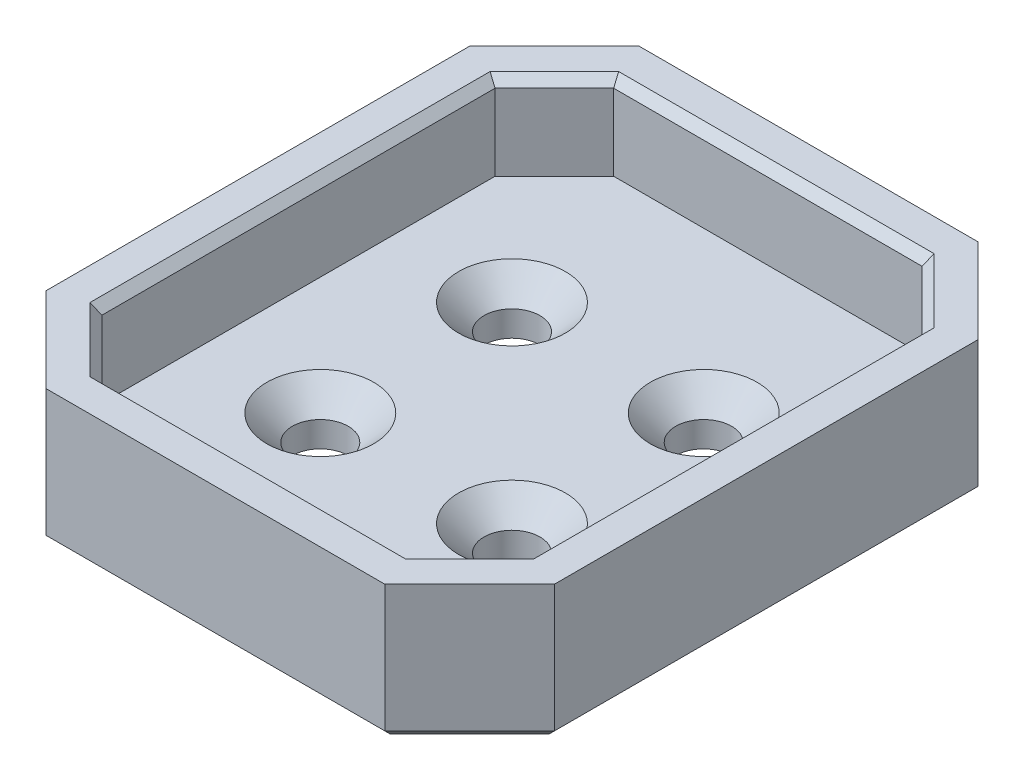
ISO-10303-21;
HEADER;
FILE_DESCRIPTION(('STEP AP214'),'2;1');
FILE_NAME('part.step','',(''),(''),'','','');
FILE_SCHEMA(('AUTOMOTIVE_DESIGN { 1 0 10303 214 1 1 1 1 }'));
ENDSEC;
DATA;
#1=APPLICATION_CONTEXT('core data for automotive mechanical design processes');
#2=APPLICATION_PROTOCOL_DEFINITION('international standard','automotive_design',2000,#1);
#3=PRODUCT_CONTEXT('',#1,'mechanical');
#4=PRODUCT('Part','Part','',(#3));
#5=PRODUCT_RELATED_PRODUCT_CATEGORY('part','',(#4));
#6=PRODUCT_DEFINITION_FORMATION('','',#4);
#7=PRODUCT_DEFINITION_CONTEXT('part definition',#1,'design');
#8=PRODUCT_DEFINITION('design','',#6,#7);
#9=PRODUCT_DEFINITION_SHAPE('','',#8);
#10=(LENGTH_UNIT() NAMED_UNIT(*) SI_UNIT(.MILLI.,.METRE.));
#11=(NAMED_UNIT(*) PLANE_ANGLE_UNIT() SI_UNIT($,.RADIAN.));
#12=(NAMED_UNIT(*) SI_UNIT($,.STERADIAN.) SOLID_ANGLE_UNIT());
#13=UNCERTAINTY_MEASURE_WITH_UNIT(LENGTH_MEASURE(1.E-05),#10,'distance_accuracy_value','');
#14=(GEOMETRIC_REPRESENTATION_CONTEXT(3) GLOBAL_UNCERTAINTY_ASSIGNED_CONTEXT((#13)) GLOBAL_UNIT_ASSIGNED_CONTEXT((#10,
#11,#12)) REPRESENTATION_CONTEXT('',''));
#15=CARTESIAN_POINT('',(0.,0.,0.));
#16=DIRECTION('',(0.,0.,1.));
#17=DIRECTION('',(1.,0.,0.));
#18=AXIS2_PLACEMENT_3D('',#15,#16,#17);
#19=CARTESIAN_POINT('',(0.,3.,0.));
#20=DIRECTION('',(0.,-1.,0.));
#21=DIRECTION('',(0.,0.,-1.));
#22=AXIS2_PLACEMENT_3D('',#19,#20,#21);
#23=PLANE('',#22);
#24=CARTESIAN_POINT('',(-5.65685424949235,3.,-5.65685424949241));
#25=DIRECTION('',(0.,1.,0.));
#26=DIRECTION('',(0.,0.,1.));
#27=AXIS2_PLACEMENT_3D('',#24,#25,#26);
#28=CIRCLE('',#27,3.15);
#29=CARTESIAN_POINT('',(-5.65685424949235,3.,-2.50685424949241));
#30=VERTEX_POINT('',#29);
#31=EDGE_CURVE('E350',#30,#30,#28,.T.);
#32=ORIENTED_EDGE('',*,*,#31,.F.);
#33=EDGE_LOOP('',(#32));
#34=FACE_BOUND('',#33,.T.);
#35=CARTESIAN_POINT('',(5.65685424949235,3.,5.65685424949241));
#36=DIRECTION('',(0.,1.,0.));
#37=DIRECTION('',(0.,0.,1.));
#38=AXIS2_PLACEMENT_3D('',#35,#36,#37);
#39=CIRCLE('',#38,3.15);
#40=CARTESIAN_POINT('',(5.65685424949235,3.,8.80685424949241));
#41=VERTEX_POINT('',#40);
#42=EDGE_CURVE('E883',#41,#41,#39,.T.);
#43=ORIENTED_EDGE('',*,*,#42,.F.);
#44=EDGE_LOOP('',(#43));
#45=FACE_BOUND('',#44,.T.);
#46=CARTESIAN_POINT('',(-5.65685424949241,3.,5.65685424949235));
#47=DIRECTION('',(0.,1.,0.));
#48=DIRECTION('',(0.,0.,1.));
#49=AXIS2_PLACEMENT_3D('',#46,#47,#48);
#50=CIRCLE('',#49,3.15);
#51=CARTESIAN_POINT('',(-5.65685424949241,3.,8.80685424949235));
#52=VERTEX_POINT('',#51);
#53=EDGE_CURVE('E897',#52,#52,#50,.T.);
#54=ORIENTED_EDGE('',*,*,#53,.F.);
#55=EDGE_LOOP('',(#54));
#56=FACE_BOUND('',#55,.T.);
#57=DIRECTION('',(-1.,0.,0.));
#58=VECTOR('',#57,1.);
#59=CARTESIAN_POINT('',(9.1,3.,-15.1));
#60=LINE('',#59,#58);
#61=CARTESIAN_POINT('',(9.1,3.,-15.1));
#62=VERTEX_POINT('',#61);
#63=CARTESIAN_POINT('',(-9.1,3.,-15.1));
#64=VERTEX_POINT('',#63);
#65=EDGE_CURVE('E223',#62,#64,#60,.T.);
#66=ORIENTED_EDGE('',*,*,#65,.T.);
#67=DIRECTION('',(-0.707106781186548,0.,0.707106781186547));
#68=VECTOR('',#67,1.);
#69=CARTESIAN_POINT('',(-9.1,3.,-15.1));
#70=LINE('',#69,#68);
#71=CARTESIAN_POINT('',(-12.6,3.,-11.6));
#72=VERTEX_POINT('',#71);
#73=EDGE_CURVE('E202',#64,#72,#70,.T.);
#74=ORIENTED_EDGE('',*,*,#73,.T.);
#75=DIRECTION('',(0.,0.,1.));
#76=VECTOR('',#75,1.);
#77=CARTESIAN_POINT('',(-12.6,3.,-11.6));
#78=LINE('',#77,#76);
#79=CARTESIAN_POINT('',(-12.6,3.,11.6));
#80=VERTEX_POINT('',#79);
#81=EDGE_CURVE('E212',#72,#80,#78,.T.);
#82=ORIENTED_EDGE('',*,*,#81,.T.);
#83=DIRECTION('',(0.707106781186547,0.,0.707106781186548));
#84=VECTOR('',#83,1.);
#85=CARTESIAN_POINT('',(-12.6,3.,11.6));
#86=LINE('',#85,#84);
#87=CARTESIAN_POINT('',(-9.1,3.,15.1));
#88=VERTEX_POINT('',#87);
#89=EDGE_CURVE('E218',#80,#88,#86,.T.);
#90=ORIENTED_EDGE('',*,*,#89,.T.);
#91=DIRECTION('',(1.,0.,0.));
#92=VECTOR('',#91,1.);
#93=CARTESIAN_POINT('',(-9.1,3.,15.1));
#94=LINE('',#93,#92);
#95=CARTESIAN_POINT('',(9.1,3.,15.1));
#96=VERTEX_POINT('',#95);
#97=EDGE_CURVE('E232',#88,#96,#94,.T.);
#98=ORIENTED_EDGE('',*,*,#97,.T.);
#99=DIRECTION('',(0.707106781186547,0.,-0.707106781186548));
#100=VECTOR('',#99,1.);
#101=CARTESIAN_POINT('',(9.1,3.,15.1));
#102=LINE('',#101,#100);
#103=CARTESIAN_POINT('',(12.6,3.,11.6));
#104=VERTEX_POINT('',#103);
#105=EDGE_CURVE('E235',#96,#104,#102,.T.);
#106=ORIENTED_EDGE('',*,*,#105,.T.);
#107=DIRECTION('',(0.,0.,-1.));
#108=VECTOR('',#107,1.);
#109=CARTESIAN_POINT('',(12.6,3.,11.6));
#110=LINE('',#109,#108);
#111=CARTESIAN_POINT('',(12.6,3.,-11.6));
#112=VERTEX_POINT('',#111);
#113=EDGE_CURVE('E238',#104,#112,#110,.T.);
#114=ORIENTED_EDGE('',*,*,#113,.T.);
#115=DIRECTION('',(-0.707106781186546,0.,-0.707106781186549));
#116=VECTOR('',#115,1.);
#117=CARTESIAN_POINT('',(12.6,3.,-11.6));
#118=LINE('',#117,#116);
#119=EDGE_CURVE('E241',#112,#62,#118,.T.);
#120=ORIENTED_EDGE('',*,*,#119,.T.);
#121=EDGE_LOOP('',(#66,#74,#82,#90,#98,#106,#114,#120));
#122=FACE_BOUND('',#121,.T.);
#123=CARTESIAN_POINT('',(5.65685424949241,3.,-5.65685424949235));
#124=DIRECTION('',(0.,1.,0.));
#125=DIRECTION('',(0.,0.,1.));
#126=AXIS2_PLACEMENT_3D('',#123,#124,#125);
#127=CIRCLE('',#126,3.15);
#128=CARTESIAN_POINT('',(5.65685424949241,3.,-2.50685424949235));
#129=VERTEX_POINT('',#128);
#130=EDGE_CURVE('E890',#129,#129,#127,.T.);
#131=ORIENTED_EDGE('',*,*,#130,.F.);
#132=EDGE_LOOP('',(#131));
#133=FACE_BOUND('',#132,.T.);
#134=ADVANCED_FACE('F34',(#34,#45,#56,#122,#133),#23,.F.);
#135=CARTESIAN_POINT('',(0.,0.,0.));
#136=DIRECTION('',(0.,-1.,0.));
#137=DIRECTION('',(0.,0.,-1.));
#138=AXIS2_PLACEMENT_3D('',#135,#136,#137);
#139=PLANE('',#138);
#140=DIRECTION('',(-1.,0.,0.));
#141=VECTOR('',#140,1.);
#142=CARTESIAN_POINT('',(-10.,0.,17.));
#143=LINE('',#142,#141);
#144=CARTESIAN_POINT('',(9.79289321881343,0.,17.));
#145=VERTEX_POINT('',#144);
#146=CARTESIAN_POINT('',(-9.79289321881346,0.,17.));
#147=VERTEX_POINT('',#146);
#148=EDGE_CURVE('E362',#145,#147,#143,.T.);
#149=ORIENTED_EDGE('',*,*,#148,.T.);
#150=DIRECTION('',(-0.707106781186546,0.,-0.707106781186549));
#151=VECTOR('',#150,1.);
#152=CARTESIAN_POINT('',(-13.3964466094068,0.,13.3964466094067));
#153=LINE('',#152,#151);
#154=CARTESIAN_POINT('',(-14.5,0.,12.2928932188134));
#155=VERTEX_POINT('',#154);
#156=EDGE_CURVE('E364',#147,#155,#153,.T.);
#157=ORIENTED_EDGE('',*,*,#156,.T.);
#158=DIRECTION('',(0.,0.,-1.));
#159=VECTOR('',#158,1.);
#160=CARTESIAN_POINT('',(-14.5,0.,-12.5));
#161=LINE('',#160,#159);
#162=CARTESIAN_POINT('',(-14.5,0.,-12.2928932188135));
#163=VERTEX_POINT('',#162);
#164=EDGE_CURVE('E327',#155,#163,#161,.T.);
#165=ORIENTED_EDGE('',*,*,#164,.T.);
#166=DIRECTION('',(0.707106781186549,0.,-0.707106781186546));
#167=VECTOR('',#166,1.);
#168=CARTESIAN_POINT('',(-13.3964466094067,0.,-13.3964466094068));
#169=LINE('',#168,#167);
#170=CARTESIAN_POINT('',(-9.79289321881344,0.,-17.));
#171=VERTEX_POINT('',#170);
#172=EDGE_CURVE('E352',#163,#171,#169,.T.);
#173=ORIENTED_EDGE('',*,*,#172,.T.);
#174=DIRECTION('',(1.,0.,0.));
#175=VECTOR('',#174,1.);
#176=CARTESIAN_POINT('',(10.,0.,-17.));
#177=LINE('',#176,#175);
#178=CARTESIAN_POINT('',(9.79289321881346,0.,-17.));
#179=VERTEX_POINT('',#178);
#180=EDGE_CURVE('E354',#171,#179,#177,.T.);
#181=ORIENTED_EDGE('',*,*,#180,.T.);
#182=DIRECTION('',(0.707106781186547,0.,0.707106781186549));
#183=VECTOR('',#182,1.);
#184=CARTESIAN_POINT('',(13.3964466094067,0.,-13.3964466094067));
#185=LINE('',#184,#183);
#186=CARTESIAN_POINT('',(14.5,0.,-12.2928932188134));
#187=VERTEX_POINT('',#186);
#188=EDGE_CURVE('E356',#179,#187,#185,.T.);
#189=ORIENTED_EDGE('',*,*,#188,.T.);
#190=DIRECTION('',(0.,0.,1.));
#191=VECTOR('',#190,1.);
#192=CARTESIAN_POINT('',(14.5,0.,12.5));
#193=LINE('',#192,#191);
#194=CARTESIAN_POINT('',(14.5,0.,12.2928932188135));
#195=VERTEX_POINT('',#194);
#196=EDGE_CURVE('E358',#187,#195,#193,.T.);
#197=ORIENTED_EDGE('',*,*,#196,.T.);
#198=DIRECTION('',(-0.707106781186549,0.,0.707106781186546));
#199=VECTOR('',#198,1.);
#200=CARTESIAN_POINT('',(13.3964466094067,0.,13.3964466094068));
#201=LINE('',#200,#199);
#202=EDGE_CURVE('E360',#195,#145,#201,.T.);
#203=ORIENTED_EDGE('',*,*,#202,.T.);
#204=EDGE_LOOP('',(#149,#157,#165,#173,#181,#189,#197,#203));
#205=FACE_BOUND('',#204,.T.);
#206=CARTESIAN_POINT('',(-5.65685424949235,0.,-5.65685424949241));
#207=DIRECTION('',(0.,1.,0.));
#208=DIRECTION('',(0.,0.,1.));
#209=AXIS2_PLACEMENT_3D('',#206,#207,#208);
#210=CIRCLE('',#209,1.65);
#211=CARTESIAN_POINT('',(-5.65685424949235,0.,-4.00685424949241));
#212=VERTEX_POINT('',#211);
#213=EDGE_CURVE('E873',#212,#212,#210,.T.);
#214=ORIENTED_EDGE('',*,*,#213,.T.);
#215=EDGE_LOOP('',(#214));
#216=FACE_BOUND('',#215,.T.);
#217=CARTESIAN_POINT('',(-5.65685424949241,0.,5.65685424949235));
#218=DIRECTION('',(0.,1.,0.));
#219=DIRECTION('',(0.,0.,1.));
#220=AXIS2_PLACEMENT_3D('',#217,#218,#219);
#221=CIRCLE('',#220,1.65);
#222=CARTESIAN_POINT('',(-5.65685424949241,0.,7.30685424949235));
#223=VERTEX_POINT('',#222);
#224=EDGE_CURVE('E224',#223,#223,#221,.T.);
#225=ORIENTED_EDGE('',*,*,#224,.T.);
#226=EDGE_LOOP('',(#225));
#227=FACE_BOUND('',#226,.T.);
#228=CARTESIAN_POINT('',(5.65685424949235,0.,5.65685424949241));
#229=DIRECTION('',(0.,1.,0.));
#230=DIRECTION('',(0.,0.,1.));
#231=AXIS2_PLACEMENT_3D('',#228,#229,#230);
#232=CIRCLE('',#231,1.65);
#233=CARTESIAN_POINT('',(5.65685424949235,0.,7.30685424949241));
#234=VERTEX_POINT('',#233);
#235=EDGE_CURVE('E879',#234,#234,#232,.T.);
#236=ORIENTED_EDGE('',*,*,#235,.T.);
#237=EDGE_LOOP('',(#236));
#238=FACE_BOUND('',#237,.T.);
#239=CARTESIAN_POINT('',(5.65685424949241,0.,-5.65685424949235));
#240=DIRECTION('',(0.,1.,0.));
#241=DIRECTION('',(0.,0.,1.));
#242=AXIS2_PLACEMENT_3D('',#239,#240,#241);
#243=CIRCLE('',#242,1.65);
#244=CARTESIAN_POINT('',(5.65685424949241,0.,-4.00685424949235));
#245=VERTEX_POINT('',#244);
#246=EDGE_CURVE('E882',#245,#245,#243,.T.);
#247=ORIENTED_EDGE('',*,*,#246,.T.);
#248=EDGE_LOOP('',(#247));
#249=FACE_BOUND('',#248,.T.);
#250=ADVANCED_FACE('F458',(#205,#216,#227,#238,#249),#139,.T.);
#251=CARTESIAN_POINT('',(15.,3.,17.5));
#252=DIRECTION('',(-1.,0.,0.));
#253=DIRECTION('',(0.,0.,1.));
#254=AXIS2_PLACEMENT_3D('',#251,#252,#253);
#255=PLANE('',#254);
#256=DIRECTION('',(0.,-1.,0.));
#257=VECTOR('',#256,1.);
#258=CARTESIAN_POINT('',(15.,3.,12.5));
#259=LINE('',#258,#257);
#260=CARTESIAN_POINT('',(15.,8.,12.5));
#261=VERTEX_POINT('',#260);
#262=CARTESIAN_POINT('',(15.,0.499999999999994,12.5));
#263=VERTEX_POINT('',#262);
#264=EDGE_CURVE('E270',#261,#263,#259,.T.);
#265=ORIENTED_EDGE('',*,*,#264,.T.);
#266=DIRECTION('',(0.,0.,-1.));
#267=VECTOR('',#266,1.);
#268=CARTESIAN_POINT('',(15.,0.499999999999994,-12.5));
#269=LINE('',#268,#267);
#270=CARTESIAN_POINT('',(15.,0.499999999999994,-12.5));
#271=VERTEX_POINT('',#270);
#272=EDGE_CURVE('E374',#263,#271,#269,.T.);
#273=ORIENTED_EDGE('',*,*,#272,.T.);
#274=DIRECTION('',(0.,1.,0.));
#275=VECTOR('',#274,1.);
#276=CARTESIAN_POINT('',(15.,3.,-12.5));
#277=LINE('',#276,#275);
#278=CARTESIAN_POINT('',(15.,8.,-12.5));
#279=VERTEX_POINT('',#278);
#280=EDGE_CURVE('E268',#271,#279,#277,.T.);
#281=ORIENTED_EDGE('',*,*,#280,.T.);
#282=DIRECTION('',(0.,0.,-1.));
#283=VECTOR('',#282,1.);
#284=CARTESIAN_POINT('',(15.,8.,17.5));
#285=LINE('',#284,#283);
#286=EDGE_CURVE('E262',#261,#279,#285,.T.);
#287=ORIENTED_EDGE('',*,*,#286,.F.);
#288=EDGE_LOOP('',(#265,#273,#281,#287));
#289=FACE_BOUND('',#288,.T.);
#290=ADVANCED_FACE('F456',(#289),#255,.F.);
#291=CARTESIAN_POINT('',(-15.,3.,-17.5));
#292=DIRECTION('',(0.,0.,1.));
#293=DIRECTION('',(1.,0.,0.));
#294=AXIS2_PLACEMENT_3D('',#291,#292,#293);
#295=PLANE('',#294);
#296=DIRECTION('',(0.,-1.,0.));
#297=VECTOR('',#296,1.);
#298=CARTESIAN_POINT('',(10.,3.,-17.5));
#299=LINE('',#298,#297);
#300=CARTESIAN_POINT('',(10.,8.,-17.5));
#301=VERTEX_POINT('',#300);
#302=CARTESIAN_POINT('',(10.,0.499999999999994,-17.5));
#303=VERTEX_POINT('',#302);
#304=EDGE_CURVE('E292',#301,#303,#299,.T.);
#305=ORIENTED_EDGE('',*,*,#304,.T.);
#306=DIRECTION('',(-1.,0.,0.));
#307=VECTOR('',#306,1.);
#308=CARTESIAN_POINT('',(-9.99999999999999,0.499999999999994,-17.5));
#309=LINE('',#308,#307);
#310=CARTESIAN_POINT('',(-9.99999999999999,0.499999999999994,-17.5));
#311=VERTEX_POINT('',#310);
#312=EDGE_CURVE('E58',#303,#311,#309,.T.);
#313=ORIENTED_EDGE('',*,*,#312,.T.);
#314=DIRECTION('',(0.,1.,0.));
#315=VECTOR('',#314,1.);
#316=CARTESIAN_POINT('',(-9.99999999999999,3.,-17.5));
#317=LINE('',#316,#315);
#318=CARTESIAN_POINT('',(-9.99999999999999,8.,-17.5));
#319=VERTEX_POINT('',#318);
#320=EDGE_CURVE('E290',#311,#319,#317,.T.);
#321=ORIENTED_EDGE('',*,*,#320,.T.);
#322=DIRECTION('',(-1.,0.,0.));
#323=VECTOR('',#322,1.);
#324=CARTESIAN_POINT('',(15.,8.,-17.5));
#325=LINE('',#324,#323);
#326=EDGE_CURVE('E265',#301,#319,#325,.T.);
#327=ORIENTED_EDGE('',*,*,#326,.F.);
#328=EDGE_LOOP('',(#305,#313,#321,#327));
#329=FACE_BOUND('',#328,.T.);
#330=ADVANCED_FACE('F416',(#329),#295,.F.);
#331=CARTESIAN_POINT('',(-15.,3.,17.5));
#332=DIRECTION('',(1.,0.,0.));
#333=DIRECTION('',(0.,0.,-1.));
#334=AXIS2_PLACEMENT_3D('',#331,#332,#333);
#335=PLANE('',#334);
#336=DIRECTION('',(0.,-1.,0.));
#337=VECTOR('',#336,1.);
#338=CARTESIAN_POINT('',(-15.,3.,-12.5));
#339=LINE('',#338,#337);
#340=CARTESIAN_POINT('',(-15.,8.,-12.5));
#341=VERTEX_POINT('',#340);
#342=CARTESIAN_POINT('',(-15.,0.499999999999994,-12.5));
#343=VERTEX_POINT('',#342);
#344=EDGE_CURVE('E286',#341,#343,#339,.T.);
#345=ORIENTED_EDGE('',*,*,#344,.T.);
#346=DIRECTION('',(0.,0.,1.));
#347=VECTOR('',#346,1.);
#348=CARTESIAN_POINT('',(-15.,0.499999999999994,12.5));
#349=LINE('',#348,#347);
#350=CARTESIAN_POINT('',(-15.,0.499999999999994,12.5));
#351=VERTEX_POINT('',#350);
#352=EDGE_CURVE('E11',#343,#351,#349,.T.);
#353=ORIENTED_EDGE('',*,*,#352,.T.);
#354=DIRECTION('',(0.,1.,0.));
#355=VECTOR('',#354,1.);
#356=CARTESIAN_POINT('',(-15.,3.,12.5));
#357=LINE('',#356,#355);
#358=CARTESIAN_POINT('',(-15.,8.,12.5));
#359=VERTEX_POINT('',#358);
#360=EDGE_CURVE('E288',#351,#359,#357,.T.);
#361=ORIENTED_EDGE('',*,*,#360,.T.);
#362=DIRECTION('',(0.,0.,1.));
#363=VECTOR('',#362,1.);
#364=CARTESIAN_POINT('',(-15.,8.,-17.5));
#365=LINE('',#364,#363);
#366=EDGE_CURVE('E208',#341,#359,#365,.T.);
#367=ORIENTED_EDGE('',*,*,#366,.F.);
#368=EDGE_LOOP('',(#345,#353,#361,#367));
#369=FACE_BOUND('',#368,.T.);
#370=ADVANCED_FACE('F425',(#369),#335,.F.);
#371=CARTESIAN_POINT('',(-15.,3.,17.5));
#372=DIRECTION('',(0.,0.,-1.));
#373=DIRECTION('',(-1.,0.,0.));
#374=AXIS2_PLACEMENT_3D('',#371,#372,#373);
#375=PLANE('',#374);
#376=DIRECTION('',(0.,-1.,0.));
#377=VECTOR('',#376,1.);
#378=CARTESIAN_POINT('',(-10.,3.,17.5));
#379=LINE('',#378,#377);
#380=CARTESIAN_POINT('',(-10.,8.,17.5));
#381=VERTEX_POINT('',#380);
#382=CARTESIAN_POINT('',(-10.,0.499999999999994,17.5));
#383=VERTEX_POINT('',#382);
#384=EDGE_CURVE('E273',#381,#383,#379,.T.);
#385=ORIENTED_EDGE('',*,*,#384,.T.);
#386=DIRECTION('',(1.,0.,0.));
#387=VECTOR('',#386,1.);
#388=CARTESIAN_POINT('',(9.99999999999998,0.499999999999994,17.5));
#389=LINE('',#388,#387);
#390=CARTESIAN_POINT('',(9.99999999999998,0.499999999999994,17.5));
#391=VERTEX_POINT('',#390);
#392=EDGE_CURVE('E370',#383,#391,#389,.T.);
#393=ORIENTED_EDGE('',*,*,#392,.T.);
#394=DIRECTION('',(0.,1.,0.));
#395=VECTOR('',#394,1.);
#396=CARTESIAN_POINT('',(9.99999999999998,3.,17.5));
#397=LINE('',#396,#395);
#398=CARTESIAN_POINT('',(9.99999999999998,8.,17.5));
#399=VERTEX_POINT('',#398);
#400=EDGE_CURVE('E276',#391,#399,#397,.T.);
#401=ORIENTED_EDGE('',*,*,#400,.T.);
#402=DIRECTION('',(1.,0.,0.));
#403=VECTOR('',#402,1.);
#404=CARTESIAN_POINT('',(-15.,8.,17.5));
#405=LINE('',#404,#403);
#406=EDGE_CURVE('E259',#381,#399,#405,.T.);
#407=ORIENTED_EDGE('',*,*,#406,.F.);
#408=EDGE_LOOP('',(#385,#393,#401,#407));
#409=FACE_BOUND('',#408,.T.);
#410=ADVANCED_FACE('F447',(#409),#375,.F.);
#411=CARTESIAN_POINT('',(0.,8.,0.));
#412=DIRECTION('',(0.,1.,0.));
#413=DIRECTION('',(0.,0.,1.));
#414=AXIS2_PLACEMENT_3D('',#411,#412,#413);
#415=PLANE('',#414);
#416=DIRECTION('',(1.,0.,0.));
#417=VECTOR('',#416,1.);
#418=CARTESIAN_POINT('',(0.,8.,-15.6));
#419=LINE('',#418,#417);
#420=CARTESIAN_POINT('',(-9.30710678118655,8.,-15.6));
#421=VERTEX_POINT('',#420);
#422=CARTESIAN_POINT('',(9.30710678118655,8.,-15.6));
#423=VERTEX_POINT('',#422);
#424=EDGE_CURVE('E299',#421,#423,#419,.T.);
#425=ORIENTED_EDGE('',*,*,#424,.T.);
#426=DIRECTION('',(0.707106781186546,0.,0.707106781186549));
#427=VECTOR('',#426,1.);
#428=CARTESIAN_POINT('',(12.4535533905933,8.,-12.4535533905933));
#429=LINE('',#428,#427);
#430=CARTESIAN_POINT('',(13.1,8.,-11.8071067811866));
#431=VERTEX_POINT('',#430);
#432=EDGE_CURVE('E311',#423,#431,#429,.T.);
#433=ORIENTED_EDGE('',*,*,#432,.T.);
#434=DIRECTION('',(0.,0.,1.));
#435=VECTOR('',#434,1.);
#436=CARTESIAN_POINT('',(13.1,8.,0.));
#437=LINE('',#436,#435);
#438=CARTESIAN_POINT('',(13.1,8.,11.8071067811866));
#439=VERTEX_POINT('',#438);
#440=EDGE_CURVE('E309',#431,#439,#437,.T.);
#441=ORIENTED_EDGE('',*,*,#440,.T.);
#442=DIRECTION('',(-0.707106781186547,0.,0.707106781186548));
#443=VECTOR('',#442,1.);
#444=CARTESIAN_POINT('',(12.4535533905933,8.,12.4535533905933));
#445=LINE('',#444,#443);
#446=CARTESIAN_POINT('',(9.30710678118654,8.,15.6));
#447=VERTEX_POINT('',#446);
#448=EDGE_CURVE('E307',#439,#447,#445,.T.);
#449=ORIENTED_EDGE('',*,*,#448,.T.);
#450=DIRECTION('',(-1.,0.,0.));
#451=VECTOR('',#450,1.);
#452=CARTESIAN_POINT('',(0.,8.,15.6));
#453=LINE('',#452,#451);
#454=CARTESIAN_POINT('',(-9.30710678118655,8.,15.6));
#455=VERTEX_POINT('',#454);
#456=EDGE_CURVE('E305',#447,#455,#453,.T.);
#457=ORIENTED_EDGE('',*,*,#456,.T.);
#458=DIRECTION('',(-0.707106781186547,0.,-0.707106781186548));
#459=VECTOR('',#458,1.);
#460=CARTESIAN_POINT('',(-12.4535533905933,8.,12.4535533905933));
#461=LINE('',#460,#459);
#462=CARTESIAN_POINT('',(-13.1,8.,11.8071067811866));
#463=VERTEX_POINT('',#462);
#464=EDGE_CURVE('E303',#455,#463,#461,.T.);
#465=ORIENTED_EDGE('',*,*,#464,.T.);
#466=DIRECTION('',(0.,0.,-1.));
#467=VECTOR('',#466,1.);
#468=CARTESIAN_POINT('',(-13.1,8.,0.));
#469=LINE('',#468,#467);
#470=CARTESIAN_POINT('',(-13.1,8.,-11.8071067811866));
#471=VERTEX_POINT('',#470);
#472=EDGE_CURVE('E301',#463,#471,#469,.T.);
#473=ORIENTED_EDGE('',*,*,#472,.T.);
#474=DIRECTION('',(0.707106781186548,0.,-0.707106781186547));
#475=VECTOR('',#474,1.);
#476=CARTESIAN_POINT('',(-12.4535533905933,8.,-12.4535533905933));
#477=LINE('',#476,#475);
#478=EDGE_CURVE('E297',#471,#421,#477,.T.);
#479=ORIENTED_EDGE('',*,*,#478,.T.);
#480=EDGE_LOOP('',(#425,#433,#441,#449,#457,#465,#473,#479));
#481=FACE_BOUND('',#480,.T.);
#482=ORIENTED_EDGE('',*,*,#406,.T.);
#483=DIRECTION('',(-0.707106781186549,0.,0.707106781186546));
#484=VECTOR('',#483,1.);
#485=CARTESIAN_POINT('',(13.75,8.,13.75));
#486=LINE('',#485,#484);
#487=EDGE_CURVE('E284',#399,#261,#486,.F.);
#488=ORIENTED_EDGE('',*,*,#487,.T.);
#489=ORIENTED_EDGE('',*,*,#286,.T.);
#490=DIRECTION('',(0.707106781186547,0.,0.707106781186549));
#491=VECTOR('',#490,1.);
#492=CARTESIAN_POINT('',(13.75,8.,-13.75));
#493=LINE('',#492,#491);
#494=EDGE_CURVE('E280',#279,#301,#493,.F.);
#495=ORIENTED_EDGE('',*,*,#494,.T.);
#496=ORIENTED_EDGE('',*,*,#326,.T.);
#497=DIRECTION('',(0.707106781186549,0.,-0.707106781186546));
#498=VECTOR('',#497,1.);
#499=CARTESIAN_POINT('',(-13.75,8.,-13.75));
#500=LINE('',#499,#498);
#501=EDGE_CURVE('E278',#319,#341,#500,.F.);
#502=ORIENTED_EDGE('',*,*,#501,.T.);
#503=ORIENTED_EDGE('',*,*,#366,.T.);
#504=DIRECTION('',(-0.707106781186546,0.,-0.707106781186549));
#505=VECTOR('',#504,1.);
#506=CARTESIAN_POINT('',(-13.75,8.,13.75));
#507=LINE('',#506,#505);
#508=EDGE_CURVE('E282',#359,#381,#507,.F.);
#509=ORIENTED_EDGE('',*,*,#508,.T.);
#510=EDGE_LOOP('',(#482,#488,#489,#495,#496,#502,#503,#509));
#511=FACE_BOUND('',#510,.T.);
#512=ADVANCED_FACE('F419',(#481,#511),#415,.T.);
#513=CARTESIAN_POINT('',(-9.1,8.,-15.1));
#514=DIRECTION('',(0.707106781186547,0.,0.707106781186548));
#515=DIRECTION('',(0.707106781186548,0.,-0.707106781186547));
#516=AXIS2_PLACEMENT_3D('',#513,#514,#515);
#517=PLANE('',#516);
#518=DIRECTION('',(0.,-1.,0.));
#519=VECTOR('',#518,1.);
#520=CARTESIAN_POINT('',(-9.1,8.,-15.1));
#521=LINE('',#520,#519);
#522=CARTESIAN_POINT('',(-9.1,7.50000000000001,-15.1));
#523=VERTEX_POINT('',#522);
#524=EDGE_CURVE('E244',#523,#64,#521,.T.);
#525=ORIENTED_EDGE('',*,*,#524,.F.);
#526=DIRECTION('',(-0.707106781186548,0.,0.707106781186547));
#527=VECTOR('',#526,1.);
#528=CARTESIAN_POINT('',(-9.1,7.50000000000001,-15.1));
#529=LINE('',#528,#527);
#530=CARTESIAN_POINT('',(-12.6,7.50000000000001,-11.6));
#531=VERTEX_POINT('',#530);
#532=EDGE_CURVE('E205',#523,#531,#529,.T.);
#533=ORIENTED_EDGE('',*,*,#532,.T.);
#534=DIRECTION('',(0.,-1.,0.));
#535=VECTOR('',#534,1.);
#536=CARTESIAN_POINT('',(-12.6,8.,-11.6));
#537=LINE('',#536,#535);
#538=EDGE_CURVE('E197',#531,#72,#537,.T.);
#539=ORIENTED_EDGE('',*,*,#538,.T.);
#540=ORIENTED_EDGE('',*,*,#73,.F.);
#541=EDGE_LOOP('',(#525,#533,#539,#540));
#542=FACE_BOUND('',#541,.T.);
#543=ADVANCED_FACE('F200',(#542),#517,.T.);
#544=CARTESIAN_POINT('',(-12.6,8.,-11.6));
#545=DIRECTION('',(1.,0.,0.));
#546=DIRECTION('',(0.,0.,-1.));
#547=AXIS2_PLACEMENT_3D('',#544,#545,#546);
#548=PLANE('',#547);
#549=ORIENTED_EDGE('',*,*,#538,.F.);
#550=DIRECTION('',(0.,0.,1.));
#551=VECTOR('',#550,1.);
#552=CARTESIAN_POINT('',(-12.6,7.50000000000001,-11.6));
#553=LINE('',#552,#551);
#554=CARTESIAN_POINT('',(-12.6,7.50000000000001,11.6));
#555=VERTEX_POINT('',#554);
#556=EDGE_CURVE('E322',#531,#555,#553,.T.);
#557=ORIENTED_EDGE('',*,*,#556,.T.);
#558=DIRECTION('',(0.,-1.,0.));
#559=VECTOR('',#558,1.);
#560=CARTESIAN_POINT('',(-12.6,8.,11.6));
#561=LINE('',#560,#559);
#562=EDGE_CURVE('E209',#555,#80,#561,.T.);
#563=ORIENTED_EDGE('',*,*,#562,.T.);
#564=ORIENTED_EDGE('',*,*,#81,.F.);
#565=EDGE_LOOP('',(#549,#557,#563,#564));
#566=FACE_BOUND('',#565,.T.);
#567=ADVANCED_FACE('F213',(#566),#548,.T.);
#568=CARTESIAN_POINT('',(-12.6,8.,11.6));
#569=DIRECTION('',(0.707106781186548,0.,-0.707106781186547));
#570=DIRECTION('',(-0.707106781186547,0.,-0.707106781186548));
#571=AXIS2_PLACEMENT_3D('',#568,#569,#570);
#572=PLANE('',#571);
#573=ORIENTED_EDGE('',*,*,#562,.F.);
#574=DIRECTION('',(0.707106781186547,0.,0.707106781186548));
#575=VECTOR('',#574,1.);
#576=CARTESIAN_POINT('',(-12.6,7.50000000000001,11.6));
#577=LINE('',#576,#575);
#578=CARTESIAN_POINT('',(-9.1,7.50000000000001,15.1));
#579=VERTEX_POINT('',#578);
#580=EDGE_CURVE('E320',#555,#579,#577,.T.);
#581=ORIENTED_EDGE('',*,*,#580,.T.);
#582=DIRECTION('',(0.,-1.,0.));
#583=VECTOR('',#582,1.);
#584=CARTESIAN_POINT('',(-9.1,8.,15.1));
#585=LINE('',#584,#583);
#586=EDGE_CURVE('E254',#579,#88,#585,.T.);
#587=ORIENTED_EDGE('',*,*,#586,.T.);
#588=ORIENTED_EDGE('',*,*,#89,.F.);
#589=EDGE_LOOP('',(#573,#581,#587,#588));
#590=FACE_BOUND('',#589,.T.);
#591=ADVANCED_FACE('F508',(#590),#572,.T.);
#592=CARTESIAN_POINT('',(-9.1,8.,15.1));
#593=DIRECTION('',(0.,0.,-1.));
#594=DIRECTION('',(-1.,0.,0.));
#595=AXIS2_PLACEMENT_3D('',#592,#593,#594);
#596=PLANE('',#595);
#597=ORIENTED_EDGE('',*,*,#586,.F.);
#598=DIRECTION('',(1.,0.,0.));
#599=VECTOR('',#598,1.);
#600=CARTESIAN_POINT('',(-9.1,7.50000000000001,15.1));
#601=LINE('',#600,#599);
#602=CARTESIAN_POINT('',(9.1,7.50000000000001,15.1));
#603=VERTEX_POINT('',#602);
#604=EDGE_CURVE('E318',#579,#603,#601,.T.);
#605=ORIENTED_EDGE('',*,*,#604,.T.);
#606=DIRECTION('',(0.,-1.,0.));
#607=VECTOR('',#606,1.);
#608=CARTESIAN_POINT('',(9.1,8.,15.1));
#609=LINE('',#608,#607);
#610=EDGE_CURVE('E252',#603,#96,#609,.T.);
#611=ORIENTED_EDGE('',*,*,#610,.T.);
#612=ORIENTED_EDGE('',*,*,#97,.F.);
#613=EDGE_LOOP('',(#597,#605,#611,#612));
#614=FACE_BOUND('',#613,.T.);
#615=ADVANCED_FACE('F515',(#614),#596,.T.);
#616=CARTESIAN_POINT('',(9.1,8.,15.1));
#617=DIRECTION('',(-0.707106781186548,0.,-0.707106781186547));
#618=DIRECTION('',(-0.707106781186547,0.,0.707106781186548));
#619=AXIS2_PLACEMENT_3D('',#616,#617,#618);
#620=PLANE('',#619);
#621=ORIENTED_EDGE('',*,*,#610,.F.);
#622=DIRECTION('',(0.707106781186547,0.,-0.707106781186548));
#623=VECTOR('',#622,1.);
#624=CARTESIAN_POINT('',(9.1,7.50000000000001,15.1));
#625=LINE('',#624,#623);
#626=CARTESIAN_POINT('',(12.6,7.50000000000001,11.6));
#627=VERTEX_POINT('',#626);
#628=EDGE_CURVE('E316',#603,#627,#625,.T.);
#629=ORIENTED_EDGE('',*,*,#628,.T.);
#630=DIRECTION('',(0.,-1.,0.));
#631=VECTOR('',#630,1.);
#632=CARTESIAN_POINT('',(12.6,8.,11.6));
#633=LINE('',#632,#631);
#634=EDGE_CURVE('E250',#627,#104,#633,.T.);
#635=ORIENTED_EDGE('',*,*,#634,.T.);
#636=ORIENTED_EDGE('',*,*,#105,.F.);
#637=EDGE_LOOP('',(#621,#629,#635,#636));
#638=FACE_BOUND('',#637,.T.);
#639=ADVANCED_FACE('F523',(#638),#620,.T.);
#640=CARTESIAN_POINT('',(12.6,8.,11.6));
#641=DIRECTION('',(-1.,0.,0.));
#642=DIRECTION('',(0.,0.,1.));
#643=AXIS2_PLACEMENT_3D('',#640,#641,#642);
#644=PLANE('',#643);
#645=ORIENTED_EDGE('',*,*,#634,.F.);
#646=DIRECTION('',(0.,0.,-1.));
#647=VECTOR('',#646,1.);
#648=CARTESIAN_POINT('',(12.6,7.50000000000001,11.6));
#649=LINE('',#648,#647);
#650=CARTESIAN_POINT('',(12.6,7.50000000000001,-11.6));
#651=VERTEX_POINT('',#650);
#652=EDGE_CURVE('E314',#627,#651,#649,.T.);
#653=ORIENTED_EDGE('',*,*,#652,.T.);
#654=DIRECTION('',(0.,-1.,0.));
#655=VECTOR('',#654,1.);
#656=CARTESIAN_POINT('',(12.6,8.,-11.6));
#657=LINE('',#656,#655);
#658=EDGE_CURVE('E248',#651,#112,#657,.T.);
#659=ORIENTED_EDGE('',*,*,#658,.T.);
#660=ORIENTED_EDGE('',*,*,#113,.F.);
#661=EDGE_LOOP('',(#645,#653,#659,#660));
#662=FACE_BOUND('',#661,.T.);
#663=ADVANCED_FACE('F531',(#662),#644,.T.);
#664=CARTESIAN_POINT('',(12.6,8.,-11.6));
#665=DIRECTION('',(-0.707106781186549,0.,0.707106781186546));
#666=DIRECTION('',(0.707106781186546,0.,0.707106781186549));
#667=AXIS2_PLACEMENT_3D('',#664,#665,#666);
#668=PLANE('',#667);
#669=ORIENTED_EDGE('',*,*,#658,.F.);
#670=DIRECTION('',(-0.707106781186546,0.,-0.707106781186549));
#671=VECTOR('',#670,1.);
#672=CARTESIAN_POINT('',(12.6,7.50000000000001,-11.6));
#673=LINE('',#672,#671);
#674=CARTESIAN_POINT('',(9.1,7.50000000000001,-15.1));
#675=VERTEX_POINT('',#674);
#676=EDGE_CURVE('E294',#651,#675,#673,.T.);
#677=ORIENTED_EDGE('',*,*,#676,.T.);
#678=DIRECTION('',(0.,-1.,0.));
#679=VECTOR('',#678,1.);
#680=CARTESIAN_POINT('',(9.1,8.,-15.1));
#681=LINE('',#680,#679);
#682=EDGE_CURVE('E246',#675,#62,#681,.T.);
#683=ORIENTED_EDGE('',*,*,#682,.T.);
#684=ORIENTED_EDGE('',*,*,#119,.F.);
#685=EDGE_LOOP('',(#669,#677,#683,#684));
#686=FACE_BOUND('',#685,.T.);
#687=ADVANCED_FACE('F539',(#686),#668,.T.);
#688=CARTESIAN_POINT('',(9.1,8.,-15.1));
#689=DIRECTION('',(0.,0.,1.));
#690=DIRECTION('',(1.,0.,0.));
#691=AXIS2_PLACEMENT_3D('',#688,#689,#690);
#692=PLANE('',#691);
#693=ORIENTED_EDGE('',*,*,#682,.F.);
#694=DIRECTION('',(-1.,0.,0.));
#695=VECTOR('',#694,1.);
#696=CARTESIAN_POINT('',(9.1,7.50000000000001,-15.1));
#697=LINE('',#696,#695);
#698=EDGE_CURVE('E324',#675,#523,#697,.T.);
#699=ORIENTED_EDGE('',*,*,#698,.T.);
#700=ORIENTED_EDGE('',*,*,#524,.T.);
#701=ORIENTED_EDGE('',*,*,#65,.F.);
#702=EDGE_LOOP('',(#693,#699,#700,#701));
#703=FACE_BOUND('',#702,.T.);
#704=ADVANCED_FACE('F547',(#703),#692,.T.);
#705=CARTESIAN_POINT('',(15.,3.,12.5));
#706=DIRECTION('',(-0.707106781186546,0.,-0.707106781186549));
#707=DIRECTION('',(0.,-1.,0.));
#708=AXIS2_PLACEMENT_3D('',#705,#706,#707);
#709=PLANE('',#708);
#710=ORIENTED_EDGE('',*,*,#400,.F.);
#711=DIRECTION('',(-0.707106781186549,0.,0.707106781186546));
#712=VECTOR('',#711,1.);
#713=CARTESIAN_POINT('',(15.,0.499999999999994,12.5));
#714=LINE('',#713,#712);
#715=EDGE_CURVE('E372',#391,#263,#714,.F.);
#716=ORIENTED_EDGE('',*,*,#715,.T.);
#717=ORIENTED_EDGE('',*,*,#264,.F.);
#718=ORIENTED_EDGE('',*,*,#487,.F.);
#719=EDGE_LOOP('',(#710,#716,#717,#718));
#720=FACE_BOUND('',#719,.T.);
#721=ADVANCED_FACE('F453',(#720),#709,.F.);
#722=CARTESIAN_POINT('',(-10.,3.,17.5));
#723=DIRECTION('',(0.707106781186549,0.,-0.707106781186546));
#724=DIRECTION('',(0.,-1.,0.));
#725=AXIS2_PLACEMENT_3D('',#722,#723,#724);
#726=PLANE('',#725);
#727=ORIENTED_EDGE('',*,*,#360,.F.);
#728=DIRECTION('',(-0.707106781186546,0.,-0.707106781186549));
#729=VECTOR('',#728,1.);
#730=CARTESIAN_POINT('',(-10.,0.499999999999994,17.5));
#731=LINE('',#730,#729);
#732=EDGE_CURVE('E367',#351,#383,#731,.F.);
#733=ORIENTED_EDGE('',*,*,#732,.T.);
#734=ORIENTED_EDGE('',*,*,#384,.F.);
#735=ORIENTED_EDGE('',*,*,#508,.F.);
#736=EDGE_LOOP('',(#727,#733,#734,#735));
#737=FACE_BOUND('',#736,.T.);
#738=ADVANCED_FACE('F443',(#737),#726,.F.);
#739=CARTESIAN_POINT('',(10.,3.,-17.5));
#740=DIRECTION('',(-0.707106781186548,0.,0.707106781186546));
#741=DIRECTION('',(0.,-1.,0.));
#742=AXIS2_PLACEMENT_3D('',#739,#740,#741);
#743=PLANE('',#742);
#744=ORIENTED_EDGE('',*,*,#280,.F.);
#745=DIRECTION('',(0.707106781186547,0.,0.707106781186549));
#746=VECTOR('',#745,1.);
#747=CARTESIAN_POINT('',(10.,0.499999999999994,-17.5));
#748=LINE('',#747,#746);
#749=EDGE_CURVE('E376',#271,#303,#748,.F.);
#750=ORIENTED_EDGE('',*,*,#749,.T.);
#751=ORIENTED_EDGE('',*,*,#304,.F.);
#752=ORIENTED_EDGE('',*,*,#494,.F.);
#753=EDGE_LOOP('',(#744,#750,#751,#752));
#754=FACE_BOUND('',#753,.T.);
#755=ADVANCED_FACE('F413',(#754),#743,.F.);
#756=CARTESIAN_POINT('',(-15.,3.,-12.5));
#757=DIRECTION('',(0.707106781186546,0.,0.707106781186549));
#758=DIRECTION('',(0.,-1.,0.));
#759=AXIS2_PLACEMENT_3D('',#756,#757,#758);
#760=PLANE('',#759);
#761=ORIENTED_EDGE('',*,*,#320,.F.);
#762=DIRECTION('',(0.707106781186549,0.,-0.707106781186546));
#763=VECTOR('',#762,1.);
#764=CARTESIAN_POINT('',(-15.,0.499999999999994,-12.5));
#765=LINE('',#764,#763);
#766=EDGE_CURVE('E43',#311,#343,#765,.F.);
#767=ORIENTED_EDGE('',*,*,#766,.T.);
#768=ORIENTED_EDGE('',*,*,#344,.F.);
#769=ORIENTED_EDGE('',*,*,#501,.F.);
#770=EDGE_LOOP('',(#761,#767,#768,#769));
#771=FACE_BOUND('',#770,.T.);
#772=ADVANCED_FACE('F421',(#771),#760,.F.);
#773=CARTESIAN_POINT('',(-5.65685424949241,3.,5.65685424949235));
#774=DIRECTION('',(0.,1.,0.));
#775=DIRECTION('',(0.,0.,1.));
#776=AXIS2_PLACEMENT_3D('',#773,#774,#775);
#777=CYLINDRICAL_SURFACE('',#776,1.65);
#778=ORIENTED_EDGE('',*,*,#224,.F.);
#779=EDGE_LOOP('',(#778));
#780=FACE_BOUND('',#779,.T.);
#781=CARTESIAN_POINT('',(-5.65685424949241,1.5,5.65685424949235));
#782=DIRECTION('',(0.,1.,0.));
#783=DIRECTION('',(0.,0.,1.));
#784=AXIS2_PLACEMENT_3D('',#781,#782,#783);
#785=CIRCLE('',#784,1.65);
#786=CARTESIAN_POINT('',(-5.65685424949241,1.5,7.30685424949235));
#787=VERTEX_POINT('',#786);
#788=EDGE_CURVE('E227',#787,#787,#785,.T.);
#789=ORIENTED_EDGE('',*,*,#788,.T.);
#790=EDGE_LOOP('',(#789));
#791=FACE_BOUND('',#790,.T.);
#792=ADVANCED_FACE('F579',(#780,#791),#777,.F.);
#793=CARTESIAN_POINT('',(-5.65685424949241,3.,5.65685424949235));
#794=DIRECTION('',(0.,1.,0.));
#795=DIRECTION('',(0.,0.,1.));
#796=AXIS2_PLACEMENT_3D('',#793,#794,#795);
#797=CONICAL_SURFACE('',#796,3.15,0.785398163397448);
#798=ORIENTED_EDGE('',*,*,#788,.F.);
#799=EDGE_LOOP('',(#798));
#800=FACE_BOUND('',#799,.T.);
#801=ORIENTED_EDGE('',*,*,#53,.T.);
#802=EDGE_LOOP('',(#801));
#803=FACE_BOUND('',#802,.T.);
#804=ADVANCED_FACE('F587',(#800,#803),#797,.F.);
#805=CARTESIAN_POINT('',(5.65685424949235,3.,5.65685424949241));
#806=DIRECTION('',(0.,1.,0.));
#807=DIRECTION('',(0.,0.,1.));
#808=AXIS2_PLACEMENT_3D('',#805,#806,#807);
#809=CYLINDRICAL_SURFACE('',#808,1.65);
#810=ORIENTED_EDGE('',*,*,#235,.F.);
#811=EDGE_LOOP('',(#810));
#812=FACE_BOUND('',#811,.T.);
#813=CARTESIAN_POINT('',(5.65685424949235,1.5,5.65685424949241));
#814=DIRECTION('',(0.,1.,0.));
#815=DIRECTION('',(0.,0.,1.));
#816=AXIS2_PLACEMENT_3D('',#813,#814,#815);
#817=CIRCLE('',#816,1.65);
#818=CARTESIAN_POINT('',(5.65685424949235,1.5,7.30685424949241));
#819=VERTEX_POINT('',#818);
#820=EDGE_CURVE('E887',#819,#819,#817,.T.);
#821=ORIENTED_EDGE('',*,*,#820,.T.);
#822=EDGE_LOOP('',(#821));
#823=FACE_BOUND('',#822,.T.);
#824=ADVANCED_FACE('F595',(#812,#823),#809,.F.);
#825=CARTESIAN_POINT('',(5.65685424949235,3.,5.65685424949241));
#826=DIRECTION('',(0.,1.,0.));
#827=DIRECTION('',(0.,0.,1.));
#828=AXIS2_PLACEMENT_3D('',#825,#826,#827);
#829=CONICAL_SURFACE('',#828,3.15,0.785398163397448);
#830=ORIENTED_EDGE('',*,*,#820,.F.);
#831=EDGE_LOOP('',(#830));
#832=FACE_BOUND('',#831,.T.);
#833=ORIENTED_EDGE('',*,*,#42,.T.);
#834=EDGE_LOOP('',(#833));
#835=FACE_BOUND('',#834,.T.);
#836=ADVANCED_FACE('F603',(#832,#835),#829,.F.);
#837=CARTESIAN_POINT('',(5.65685424949241,3.,-5.65685424949235));
#838=DIRECTION('',(0.,1.,0.));
#839=DIRECTION('',(0.,0.,1.));
#840=AXIS2_PLACEMENT_3D('',#837,#838,#839);
#841=CYLINDRICAL_SURFACE('',#840,1.65);
#842=ORIENTED_EDGE('',*,*,#246,.F.);
#843=EDGE_LOOP('',(#842));
#844=FACE_BOUND('',#843,.T.);
#845=CARTESIAN_POINT('',(5.65685424949241,1.5,-5.65685424949235));
#846=DIRECTION('',(0.,1.,0.));
#847=DIRECTION('',(0.,0.,1.));
#848=AXIS2_PLACEMENT_3D('',#845,#846,#847);
#849=CIRCLE('',#848,1.65);
#850=CARTESIAN_POINT('',(5.65685424949241,1.5,-4.00685424949235));
#851=VERTEX_POINT('',#850);
#852=EDGE_CURVE('E884',#851,#851,#849,.T.);
#853=ORIENTED_EDGE('',*,*,#852,.T.);
#854=EDGE_LOOP('',(#853));
#855=FACE_BOUND('',#854,.T.);
#856=ADVANCED_FACE('F611',(#844,#855),#841,.F.);
#857=CARTESIAN_POINT('',(5.65685424949241,3.,-5.65685424949235));
#858=DIRECTION('',(0.,1.,0.));
#859=DIRECTION('',(0.,0.,1.));
#860=AXIS2_PLACEMENT_3D('',#857,#858,#859);
#861=CONICAL_SURFACE('',#860,3.15,0.785398163397448);
#862=ORIENTED_EDGE('',*,*,#852,.F.);
#863=EDGE_LOOP('',(#862));
#864=FACE_BOUND('',#863,.T.);
#865=ORIENTED_EDGE('',*,*,#130,.T.);
#866=EDGE_LOOP('',(#865));
#867=FACE_BOUND('',#866,.T.);
#868=ADVANCED_FACE('F619',(#864,#867),#861,.F.);
#869=CARTESIAN_POINT('',(-5.65685424949235,3.,-5.65685424949241));
#870=DIRECTION('',(0.,1.,0.));
#871=DIRECTION('',(0.,0.,1.));
#872=AXIS2_PLACEMENT_3D('',#869,#870,#871);
#873=CYLINDRICAL_SURFACE('',#872,1.65);
#874=ORIENTED_EDGE('',*,*,#213,.F.);
#875=EDGE_LOOP('',(#874));
#876=FACE_BOUND('',#875,.T.);
#877=CARTESIAN_POINT('',(-5.65685424949235,1.5,-5.65685424949241));
#878=DIRECTION('',(0.,1.,0.));
#879=DIRECTION('',(0.,0.,1.));
#880=AXIS2_PLACEMENT_3D('',#877,#878,#879);
#881=CIRCLE('',#880,1.65);
#882=CARTESIAN_POINT('',(-5.65685424949235,1.5,-4.00685424949241));
#883=VERTEX_POINT('',#882);
#884=EDGE_CURVE('E912',#883,#883,#881,.T.);
#885=ORIENTED_EDGE('',*,*,#884,.T.);
#886=EDGE_LOOP('',(#885));
#887=FACE_BOUND('',#886,.T.);
#888=ADVANCED_FACE('F627',(#876,#887),#873,.F.);
#889=CARTESIAN_POINT('',(-5.65685424949235,3.,-5.65685424949241));
#890=DIRECTION('',(0.,1.,0.));
#891=DIRECTION('',(0.,0.,1.));
#892=AXIS2_PLACEMENT_3D('',#889,#890,#891);
#893=CONICAL_SURFACE('',#892,3.15,0.785398163397448);
#894=ORIENTED_EDGE('',*,*,#884,.F.);
#895=EDGE_LOOP('',(#894));
#896=FACE_BOUND('',#895,.T.);
#897=ORIENTED_EDGE('',*,*,#31,.T.);
#898=EDGE_LOOP('',(#897));
#899=FACE_BOUND('',#898,.T.);
#900=ADVANCED_FACE('F635',(#896,#899),#893,.F.);
#901=CARTESIAN_POINT('',(-12.6,7.50000000000001,11.6));
#902=DIRECTION('',(-0.499999999999996,-0.707106781186553,0.499999999999996));
#903=DIRECTION('',(0.707106781186547,0.,0.707106781186548));
#904=AXIS2_PLACEMENT_3D('',#901,#902,#903);
#905=PLANE('',#904);
#906=DIRECTION('',(0.678598344545854,-0.67859834454584,-0.281084637714819));
#907=VECTOR('',#906,1.);
#908=CARTESIAN_POINT('',(-12.6,7.50000000000001,11.6));
#909=LINE('',#908,#907);
#910=EDGE_CURVE('E344',#463,#555,#909,.T.);
#911=ORIENTED_EDGE('',*,*,#910,.F.);
#912=ORIENTED_EDGE('',*,*,#464,.F.);
#913=DIRECTION('',(0.281084637714819,-0.67859834454584,-0.678598344545854));
#914=VECTOR('',#913,1.);
#915=CARTESIAN_POINT('',(-9.1,7.50000000000001,15.1));
#916=LINE('',#915,#914);
#917=EDGE_CURVE('E347',#579,#455,#916,.F.);
#918=ORIENTED_EDGE('',*,*,#917,.F.);
#919=ORIENTED_EDGE('',*,*,#580,.F.);
#920=EDGE_LOOP('',(#911,#912,#918,#919));
#921=FACE_BOUND('',#920,.T.);
#922=ADVANCED_FACE('F642',(#921),#905,.F.);
#923=CARTESIAN_POINT('',(-9.1,7.50000000000001,15.1));
#924=DIRECTION('',(0.,-0.707106781186555,0.70710678118654));
#925=DIRECTION('',(1.,0.,0.));
#926=AXIS2_PLACEMENT_3D('',#923,#924,#925);
#927=PLANE('',#926);
#928=ORIENTED_EDGE('',*,*,#917,.T.);
#929=ORIENTED_EDGE('',*,*,#456,.F.);
#930=DIRECTION('',(-0.281084637714819,-0.67859834454584,-0.678598344545854));
#931=VECTOR('',#930,1.);
#932=CARTESIAN_POINT('',(9.1,7.50000000000001,15.1));
#933=LINE('',#932,#931);
#934=EDGE_CURVE('E341',#603,#447,#933,.F.);
#935=ORIENTED_EDGE('',*,*,#934,.F.);
#936=ORIENTED_EDGE('',*,*,#604,.F.);
#937=EDGE_LOOP('',(#928,#929,#935,#936));
#938=FACE_BOUND('',#937,.T.);
#939=ADVANCED_FACE('F649',(#938),#927,.F.);
#940=CARTESIAN_POINT('',(-12.6,7.50000000000001,-11.6));
#941=DIRECTION('',(-0.70710678118654,-0.707106781186555,0.));
#942=DIRECTION('',(0.,0.,1.));
#943=AXIS2_PLACEMENT_3D('',#940,#941,#942);
#944=PLANE('',#943);
#945=ORIENTED_EDGE('',*,*,#910,.T.);
#946=ORIENTED_EDGE('',*,*,#556,.F.);
#947=DIRECTION('',(0.678598344545854,-0.67859834454584,0.28108463771482));
#948=VECTOR('',#947,1.);
#949=CARTESIAN_POINT('',(-12.6,7.50000000000001,-11.6));
#950=LINE('',#949,#948);
#951=EDGE_CURVE('E338',#471,#531,#950,.T.);
#952=ORIENTED_EDGE('',*,*,#951,.F.);
#953=ORIENTED_EDGE('',*,*,#472,.F.);
#954=EDGE_LOOP('',(#945,#946,#952,#953));
#955=FACE_BOUND('',#954,.T.);
#956=ADVANCED_FACE('F657',(#955),#944,.F.);
#957=CARTESIAN_POINT('',(9.1,7.50000000000001,15.1));
#958=DIRECTION('',(0.499999999999996,-0.707106781186553,0.499999999999996));
#959=DIRECTION('',(0.707106781186547,0.,-0.707106781186548));
#960=AXIS2_PLACEMENT_3D('',#957,#958,#959);
#961=PLANE('',#960);
#962=ORIENTED_EDGE('',*,*,#934,.T.);
#963=ORIENTED_EDGE('',*,*,#448,.F.);
#964=DIRECTION('',(-0.678598344545854,-0.67859834454584,-0.281084637714819));
#965=VECTOR('',#964,1.);
#966=CARTESIAN_POINT('',(12.6,7.50000000000001,11.6));
#967=LINE('',#966,#965);
#968=EDGE_CURVE('E335',#627,#439,#967,.F.);
#969=ORIENTED_EDGE('',*,*,#968,.F.);
#970=ORIENTED_EDGE('',*,*,#628,.F.);
#971=EDGE_LOOP('',(#962,#963,#969,#970));
#972=FACE_BOUND('',#971,.T.);
#973=ADVANCED_FACE('F665',(#972),#961,.F.);
#974=CARTESIAN_POINT('',(-9.1,7.50000000000001,-15.1));
#975=DIRECTION('',(-0.499999999999996,-0.707106781186554,-0.499999999999996));
#976=DIRECTION('',(-0.707106781186548,0.,0.707106781186547));
#977=AXIS2_PLACEMENT_3D('',#974,#975,#976);
#978=PLANE('',#977);
#979=ORIENTED_EDGE('',*,*,#951,.T.);
#980=ORIENTED_EDGE('',*,*,#532,.F.);
#981=DIRECTION('',(-0.28108463771482,0.67859834454584,-0.678598344545854));
#982=VECTOR('',#981,1.);
#983=CARTESIAN_POINT('',(-7.66204396122126,4.02846702908411,-11.628467029084));
#984=LINE('',#983,#982);
#985=EDGE_CURVE('E332',#421,#523,#984,.F.);
#986=ORIENTED_EDGE('',*,*,#985,.F.);
#987=ORIENTED_EDGE('',*,*,#478,.F.);
#988=EDGE_LOOP('',(#979,#980,#986,#987));
#989=FACE_BOUND('',#988,.T.);
#990=ADVANCED_FACE('F673',(#989),#978,.F.);
#991=CARTESIAN_POINT('',(12.6,7.50000000000001,11.6));
#992=DIRECTION('',(0.70710678118654,-0.707106781186555,0.));
#993=DIRECTION('',(0.,0.,-1.));
#994=AXIS2_PLACEMENT_3D('',#991,#992,#993);
#995=PLANE('',#994);
#996=ORIENTED_EDGE('',*,*,#968,.T.);
#997=ORIENTED_EDGE('',*,*,#440,.F.);
#998=DIRECTION('',(-0.678598344545853,-0.678598344545839,0.281084637714823));
#999=VECTOR('',#998,1.);
#1000=CARTESIAN_POINT('',(12.6,7.50000000000001,-11.6));
#1001=LINE('',#1000,#999);
#1002=EDGE_CURVE('E330',#651,#431,#1001,.F.);
#1003=ORIENTED_EDGE('',*,*,#1002,.F.);
#1004=ORIENTED_EDGE('',*,*,#652,.F.);
#1005=EDGE_LOOP('',(#996,#997,#1003,#1004));
#1006=FACE_BOUND('',#1005,.T.);
#1007=ADVANCED_FACE('F681',(#1006),#995,.F.);
#1008=CARTESIAN_POINT('',(9.1,7.50000000000001,-15.1));
#1009=DIRECTION('',(0.,-0.707106781186555,-0.70710678118654));
#1010=DIRECTION('',(-1.,0.,0.));
#1011=AXIS2_PLACEMENT_3D('',#1008,#1009,#1010);
#1012=PLANE('',#1011);
#1013=ORIENTED_EDGE('',*,*,#985,.T.);
#1014=ORIENTED_EDGE('',*,*,#698,.F.);
#1015=DIRECTION('',(0.281084637714824,0.678598344545839,-0.678598344545853));
#1016=VECTOR('',#1015,1.);
#1017=CARTESIAN_POINT('',(8.70892751305053,6.55586749813564,-14.1558674981356));
#1018=LINE('',#1017,#1016);
#1019=EDGE_CURVE('E328',#423,#675,#1018,.F.);
#1020=ORIENTED_EDGE('',*,*,#1019,.F.);
#1021=ORIENTED_EDGE('',*,*,#424,.F.);
#1022=EDGE_LOOP('',(#1013,#1014,#1020,#1021));
#1023=FACE_BOUND('',#1022,.T.);
#1024=ADVANCED_FACE('F689',(#1023),#1012,.F.);
#1025=CARTESIAN_POINT('',(12.6,7.50000000000001,-11.6));
#1026=DIRECTION('',(0.499999999999995,-0.707106781186555,-0.499999999999994));
#1027=DIRECTION('',(-0.707106781186546,0.,-0.707106781186549));
#1028=AXIS2_PLACEMENT_3D('',#1025,#1026,#1027);
#1029=PLANE('',#1028);
#1030=ORIENTED_EDGE('',*,*,#1002,.T.);
#1031=ORIENTED_EDGE('',*,*,#432,.F.);
#1032=ORIENTED_EDGE('',*,*,#1019,.T.);
#1033=ORIENTED_EDGE('',*,*,#676,.F.);
#1034=EDGE_LOOP('',(#1030,#1031,#1032,#1033));
#1035=FACE_BOUND('',#1034,.T.);
#1036=ADVANCED_FACE('F697',(#1035),#1029,.F.);
#1037=CARTESIAN_POINT('',(13.3964466094067,0.,-13.3964466094067));
#1038=DIRECTION('',(0.5,-0.707106781186548,-0.499999999999999));
#1039=DIRECTION('',(-0.707106781186547,0.,-0.707106781186549));
#1040=AXIS2_PLACEMENT_3D('',#1037,#1038,#1039);
#1041=PLANE('',#1040);
#1042=DIRECTION('',(-0.281084637714822,-0.678598344545847,0.678598344545847));
#1043=VECTOR('',#1042,1.);
#1044=CARTESIAN_POINT('',(8.02478566101818,-4.26858924576369,-12.7314107542363));
#1045=LINE('',#1044,#1043);
#1046=EDGE_CURVE('E395',#303,#179,#1045,.T.);
#1047=ORIENTED_EDGE('',*,*,#1046,.F.);
#1048=ORIENTED_EDGE('',*,*,#749,.F.);
#1049=DIRECTION('',(-0.678598344545847,-0.678598344545847,0.281084637714821));
#1050=VECTOR('',#1049,1.);
#1051=CARTESIAN_POINT('',(14.2023141075424,-0.29768589245763,-12.1695876848304));
#1052=LINE('',#1051,#1050);
#1053=EDGE_CURVE('E38',#187,#271,#1052,.F.);
#1054=ORIENTED_EDGE('',*,*,#1053,.F.);
#1055=ORIENTED_EDGE('',*,*,#188,.F.);
#1056=EDGE_LOOP('',(#1047,#1048,#1054,#1055));
#1057=FACE_BOUND('',#1056,.T.);
#1058=ADVANCED_FACE('F36',(#1057),#1041,.T.);
#1059=CARTESIAN_POINT('',(15.,0.499999999999994,17.5));
#1060=DIRECTION('',(0.707106781186547,-0.707106781186547,0.));
#1061=DIRECTION('',(0.,0.,1.));
#1062=AXIS2_PLACEMENT_3D('',#1059,#1060,#1061);
#1063=PLANE('',#1062);
#1064=ORIENTED_EDGE('',*,*,#1053,.T.);
#1065=ORIENTED_EDGE('',*,*,#272,.F.);
#1066=DIRECTION('',(-0.678598344545847,-0.678598344545847,-0.281084637714823));
#1067=VECTOR('',#1066,1.);
#1068=CARTESIAN_POINT('',(15.9537178491527,1.45371784915273,12.8950428677964));
#1069=LINE('',#1068,#1067);
#1070=EDGE_CURVE('E393',#195,#263,#1069,.F.);
#1071=ORIENTED_EDGE('',*,*,#1070,.F.);
#1072=ORIENTED_EDGE('',*,*,#196,.F.);
#1073=EDGE_LOOP('',(#1064,#1065,#1071,#1072));
#1074=FACE_BOUND('',#1073,.T.);
#1075=ADVANCED_FACE('F405',(#1074),#1063,.T.);
#1076=CARTESIAN_POINT('',(-15.,0.499999999999994,-17.5));
#1077=DIRECTION('',(0.,-0.707106781186547,-0.707106781186547));
#1078=DIRECTION('',(1.,0.,0.));
#1079=AXIS2_PLACEMENT_3D('',#1076,#1077,#1078);
#1080=PLANE('',#1079);
#1081=ORIENTED_EDGE('',*,*,#1046,.T.);
#1082=ORIENTED_EDGE('',*,*,#180,.F.);
#1083=DIRECTION('',(0.281084637714823,-0.678598344545846,0.678598344545846));
#1084=VECTOR('',#1083,1.);
#1085=CARTESIAN_POINT('',(-9.39025019415216,-0.972066250932162,-16.0279337490678));
#1086=LINE('',#1085,#1084);
#1087=EDGE_CURVE('E390',#311,#171,#1086,.T.);
#1088=ORIENTED_EDGE('',*,*,#1087,.F.);
#1089=ORIENTED_EDGE('',*,*,#312,.F.);
#1090=EDGE_LOOP('',(#1081,#1082,#1088,#1089));
#1091=FACE_BOUND('',#1090,.T.);
#1092=ADVANCED_FACE('F717',(#1091),#1080,.T.);
#1093=CARTESIAN_POINT('',(13.3964466094067,0.,13.3964466094068));
#1094=DIRECTION('',(0.499999999999998,-0.707106781186548,0.500000000000001));
#1095=DIRECTION('',(0.707106781186549,0.,-0.707106781186546));
#1096=AXIS2_PLACEMENT_3D('',#1093,#1094,#1095);
#1097=PLANE('',#1096);
#1098=ORIENTED_EDGE('',*,*,#1070,.T.);
#1099=ORIENTED_EDGE('',*,*,#715,.F.);
#1100=DIRECTION('',(-0.281084637714821,-0.678598344545847,-0.678598344545847));
#1101=VECTOR('',#1100,1.);
#1102=CARTESIAN_POINT('',(9.39025019415216,-0.97206625093217,16.0279337490678));
#1103=LINE('',#1102,#1101);
#1104=EDGE_CURVE('E387',#145,#391,#1103,.F.);
#1105=ORIENTED_EDGE('',*,*,#1104,.F.);
#1106=ORIENTED_EDGE('',*,*,#202,.F.);
#1107=EDGE_LOOP('',(#1098,#1099,#1105,#1106));
#1108=FACE_BOUND('',#1107,.T.);
#1109=ADVANCED_FACE('F723',(#1108),#1097,.T.);
#1110=CARTESIAN_POINT('',(-13.3964466094067,0.,-13.3964466094068));
#1111=DIRECTION('',(-0.499999999999998,-0.707106781186549,-0.5));
#1112=DIRECTION('',(-0.707106781186549,0.,0.707106781186546));
#1113=AXIS2_PLACEMENT_3D('',#1110,#1111,#1112);
#1114=PLANE('',#1113);
#1115=ORIENTED_EDGE('',*,*,#1087,.T.);
#1116=ORIENTED_EDGE('',*,*,#172,.F.);
#1117=DIRECTION('',(0.678598344545846,-0.678598344545846,0.281084637714825));
#1118=VECTOR('',#1117,1.);
#1119=CARTESIAN_POINT('',(-9.27769290508353,-5.22230709491648,-10.1297427932218));
#1120=LINE('',#1119,#1118);
#1121=EDGE_CURVE('E384',#343,#163,#1120,.T.);
#1122=ORIENTED_EDGE('',*,*,#1121,.F.);
#1123=ORIENTED_EDGE('',*,*,#766,.F.);
#1124=EDGE_LOOP('',(#1115,#1116,#1122,#1123));
#1125=FACE_BOUND('',#1124,.T.);
#1126=ADVANCED_FACE('F430',(#1125),#1114,.T.);
#1127=CARTESIAN_POINT('',(-15.,0.499999999999994,17.5));
#1128=DIRECTION('',(0.,-0.707106781186547,0.707106781186547));
#1129=DIRECTION('',(-1.,0.,0.));
#1130=AXIS2_PLACEMENT_3D('',#1127,#1128,#1129);
#1131=PLANE('',#1130);
#1132=ORIENTED_EDGE('',*,*,#1104,.T.);
#1133=ORIENTED_EDGE('',*,*,#392,.F.);
#1134=DIRECTION('',(0.281084637714823,-0.678598344545847,-0.678598344545847));
#1135=VECTOR('',#1134,1.);
#1136=CARTESIAN_POINT('',(-10.3950428677964,1.45371784915273,18.4537178491527));
#1137=LINE('',#1136,#1135);
#1138=EDGE_CURVE('E382',#147,#383,#1137,.F.);
#1139=ORIENTED_EDGE('',*,*,#1138,.F.);
#1140=ORIENTED_EDGE('',*,*,#148,.F.);
#1141=EDGE_LOOP('',(#1132,#1133,#1139,#1140));
#1142=FACE_BOUND('',#1141,.T.);
#1143=ADVANCED_FACE('F737',(#1142),#1131,.T.);
#1144=CARTESIAN_POINT('',(-15.,0.499999999999994,17.5));
#1145=DIRECTION('',(-0.707106781186547,-0.707106781186547,0.));
#1146=DIRECTION('',(0.,0.,-1.));
#1147=AXIS2_PLACEMENT_3D('',#1144,#1145,#1146);
#1148=PLANE('',#1147);
#1149=ORIENTED_EDGE('',*,*,#1121,.T.);
#1150=ORIENTED_EDGE('',*,*,#164,.F.);
#1151=DIRECTION('',(-0.678598344545847,0.678598344545847,0.281084637714821));
#1152=VECTOR('',#1151,1.);
#1153=CARTESIAN_POINT('',(-15.9537178491527,1.45371784915273,12.8950428677963));
#1154=LINE('',#1153,#1152);
#1155=EDGE_CURVE('E380',#351,#155,#1154,.F.);
#1156=ORIENTED_EDGE('',*,*,#1155,.F.);
#1157=ORIENTED_EDGE('',*,*,#352,.F.);
#1158=EDGE_LOOP('',(#1149,#1150,#1156,#1157));
#1159=FACE_BOUND('',#1158,.T.);
#1160=ADVANCED_FACE('F434',(#1159),#1148,.T.);
#1161=CARTESIAN_POINT('',(-13.3964466094068,0.,13.3964466094067));
#1162=DIRECTION('',(-0.500000000000001,-0.707106781186548,0.499999999999998));
#1163=DIRECTION('',(0.707106781186546,0.,0.707106781186549));
#1164=AXIS2_PLACEMENT_3D('',#1161,#1162,#1163);
#1165=PLANE('',#1164);
#1166=ORIENTED_EDGE('',*,*,#1138,.T.);
#1167=ORIENTED_EDGE('',*,*,#732,.F.);
#1168=ORIENTED_EDGE('',*,*,#1155,.T.);
#1169=ORIENTED_EDGE('',*,*,#156,.F.);
#1170=EDGE_LOOP('',(#1166,#1167,#1168,#1169));
#1171=FACE_BOUND('',#1170,.T.);
#1172=ADVANCED_FACE('F438',(#1171),#1165,.T.);
#1173=CLOSED_SHELL('',(#134,#250,#290,#330,#370,#410,#512,#543,#567,#591,#615,#639,#663,#687,
#704,#721,#738,#755,#772,#792,#804,#824,#836,#856,#868,#888,#900,#922,#939,#956,#973,#990,#1007,
#1024,#1036,#1058,#1075,#1092,#1109,#1126,#1143,#1160,#1172));
#1174=MANIFOLD_SOLID_BREP('B2',#1173);
#1175=ADVANCED_BREP_SHAPE_REPRESENTATION('',(#18,#1174),#14);
#1176=SHAPE_DEFINITION_REPRESENTATION(#9,#1175);
ENDSEC;
END-ISO-10303-21;
